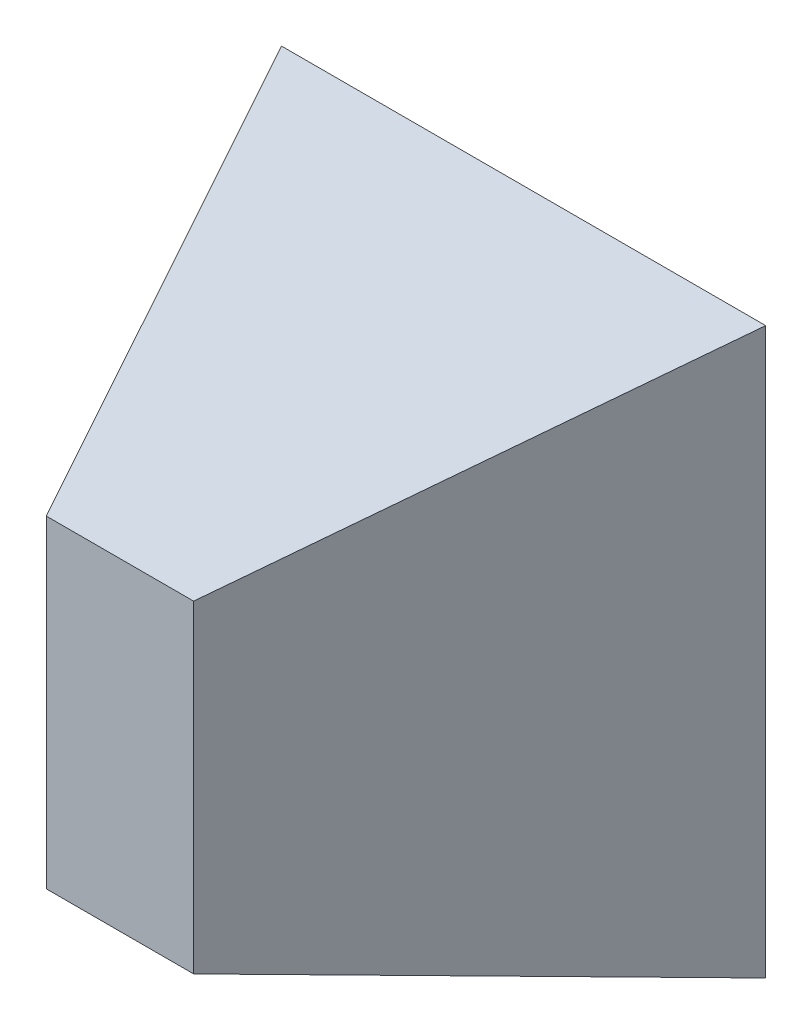
ISO-10303-21;
HEADER;
FILE_DESCRIPTION(('STEP AP214'),'2;1');
FILE_NAME('part.step','',(''),(''),'','','');
FILE_SCHEMA(('AUTOMOTIVE_DESIGN { 1 0 10303 214 1 1 1 1 }'));
ENDSEC;
DATA;
#1=APPLICATION_CONTEXT('core data for automotive mechanical design processes');
#2=APPLICATION_PROTOCOL_DEFINITION('international standard','automotive_design',2000,#1);
#3=PRODUCT_CONTEXT('',#1,'mechanical');
#4=PRODUCT('Part','Part','',(#3));
#5=PRODUCT_RELATED_PRODUCT_CATEGORY('part','',(#4));
#6=PRODUCT_DEFINITION_FORMATION('','',#4);
#7=PRODUCT_DEFINITION_CONTEXT('part definition',#1,'design');
#8=PRODUCT_DEFINITION('design','',#6,#7);
#9=PRODUCT_DEFINITION_SHAPE('','',#8);
#10=(LENGTH_UNIT() NAMED_UNIT(*) SI_UNIT(.MILLI.,.METRE.));
#11=(NAMED_UNIT(*) PLANE_ANGLE_UNIT() SI_UNIT($,.RADIAN.));
#12=(NAMED_UNIT(*) SI_UNIT($,.STERADIAN.) SOLID_ANGLE_UNIT());
#13=UNCERTAINTY_MEASURE_WITH_UNIT(LENGTH_MEASURE(1.E-05),#10,'distance_accuracy_value','');
#14=(GEOMETRIC_REPRESENTATION_CONTEXT(3) GLOBAL_UNCERTAINTY_ASSIGNED_CONTEXT((#13)) GLOBAL_UNIT_ASSIGNED_CONTEXT((#10,
#11,#12)) REPRESENTATION_CONTEXT('',''));
#15=CARTESIAN_POINT('',(0.,0.,0.));
#16=DIRECTION('',(0.,0.,1.));
#17=DIRECTION('',(1.,0.,0.));
#18=AXIS2_PLACEMENT_3D('',#15,#16,#17);
#19=CARTESIAN_POINT('',(0.,0.,0.));
#20=DIRECTION('',(0.,0.,-1.));
#21=DIRECTION('',(-1.,0.,0.));
#22=AXIS2_PLACEMENT_3D('',#19,#20,#21);
#23=PLANE('',#22);
#24=DIRECTION('',(0.,1.,0.));
#25=VECTOR('',#24,1.);
#26=CARTESIAN_POINT('',(152.4,-177.8,0.));
#27=LINE('',#26,#25);
#28=CARTESIAN_POINT('',(152.4,-177.8,0.));
#29=VERTEX_POINT('',#28);
#30=CARTESIAN_POINT('',(152.4,177.8,0.));
#31=VERTEX_POINT('',#30);
#32=EDGE_CURVE('E102',#29,#31,#27,.T.);
#33=ORIENTED_EDGE('',*,*,#32,.F.);
#34=DIRECTION('',(1.,0.,0.));
#35=VECTOR('',#34,1.);
#36=CARTESIAN_POINT('',(-152.4,-177.8,0.));
#37=LINE('',#36,#35);
#38=CARTESIAN_POINT('',(-152.4,-177.8,0.));
#39=VERTEX_POINT('',#38);
#40=EDGE_CURVE('E12',#39,#29,#37,.T.);
#41=ORIENTED_EDGE('',*,*,#40,.F.);
#42=DIRECTION('',(0.,-1.,0.));
#43=VECTOR('',#42,1.);
#44=CARTESIAN_POINT('',(-152.4,-177.8,0.));
#45=LINE('',#44,#43);
#46=CARTESIAN_POINT('',(-152.4,177.8,0.));
#47=VERTEX_POINT('',#46);
#48=EDGE_CURVE('E58',#47,#39,#45,.T.);
#49=ORIENTED_EDGE('',*,*,#48,.F.);
#50=DIRECTION('',(-1.,0.,0.));
#51=VECTOR('',#50,1.);
#52=CARTESIAN_POINT('',(-152.4,177.8,0.));
#53=LINE('',#52,#51);
#54=EDGE_CURVE('E187',#31,#47,#53,.T.);
#55=ORIENTED_EDGE('',*,*,#54,.F.);
#56=EDGE_LOOP('',(#33,#41,#49,#55));
#57=FACE_BOUND('',#56,.T.);
#58=ADVANCED_FACE('F48',(#57),#23,.T.);
#59=CARTESIAN_POINT('',(0.,0.,254.));
#60=DIRECTION('',(0.,0.,-1.));
#61=DIRECTION('',(-1.,0.,0.));
#62=AXIS2_PLACEMENT_3D('',#59,#60,#61);
#63=PLANE('',#62);
#64=DIRECTION('',(0.,1.,0.));
#65=VECTOR('',#64,1.);
#66=CARTESIAN_POINT('',(46.355,-101.6,254.));
#67=LINE('',#66,#65);
#68=CARTESIAN_POINT('',(46.355,-101.6,254.));
#69=VERTEX_POINT('',#68);
#70=CARTESIAN_POINT('',(46.355,101.6,254.));
#71=VERTEX_POINT('',#70);
#72=EDGE_CURVE('E156',#69,#71,#67,.T.);
#73=ORIENTED_EDGE('',*,*,#72,.T.);
#74=DIRECTION('',(-1.,0.,0.));
#75=VECTOR('',#74,1.);
#76=CARTESIAN_POINT('',(-46.355,101.6,254.));
#77=LINE('',#76,#75);
#78=CARTESIAN_POINT('',(-46.355,101.6,254.));
#79=VERTEX_POINT('',#78);
#80=EDGE_CURVE('E116',#71,#79,#77,.T.);
#81=ORIENTED_EDGE('',*,*,#80,.T.);
#82=DIRECTION('',(0.,-1.,0.));
#83=VECTOR('',#82,1.);
#84=CARTESIAN_POINT('',(-46.355,-101.6,254.));
#85=LINE('',#84,#83);
#86=CARTESIAN_POINT('',(-46.355,-101.6,254.));
#87=VERTEX_POINT('',#86);
#88=EDGE_CURVE('E97',#79,#87,#85,.T.);
#89=ORIENTED_EDGE('',*,*,#88,.T.);
#90=DIRECTION('',(1.,0.,0.));
#91=VECTOR('',#90,1.);
#92=CARTESIAN_POINT('',(-46.355,-101.6,254.));
#93=LINE('',#92,#91);
#94=EDGE_CURVE('E104',#87,#69,#93,.T.);
#95=ORIENTED_EDGE('',*,*,#94,.T.);
#96=EDGE_LOOP('',(#73,#81,#89,#95));
#97=FACE_BOUND('',#96,.T.);
#98=ADVANCED_FACE('F115',(#97),#63,.F.);
#99=CARTESIAN_POINT('',(0.,163.119266055046,48.9357798165137));
#100=DIRECTION('',(0.,0.957826285221151,0.287347885566345));
#101=DIRECTION('',(0.,-0.287347885566345,0.957826285221151));
#102=AXIS2_PLACEMENT_3D('',#99,#100,#101);
#103=PLANE('',#102);
#104=DIRECTION('',(0.371304606644695,0.266805705373433,-0.889352351244777));
#105=VECTOR('',#104,1.);
#106=CARTESIAN_POINT('',(46.355,101.6,254.));
#107=LINE('',#106,#105);
#108=EDGE_CURVE('E110',#71,#31,#107,.T.);
#109=ORIENTED_EDGE('',*,*,#108,.T.);
#110=ORIENTED_EDGE('',*,*,#54,.T.);
#111=DIRECTION('',(-0.371304606644694,0.266805705373433,-0.889352351244777));
#112=VECTOR('',#111,1.);
#113=CARTESIAN_POINT('',(-46.355,101.6,254.));
#114=LINE('',#113,#112);
#115=EDGE_CURVE('E200',#79,#47,#114,.T.);
#116=ORIENTED_EDGE('',*,*,#115,.F.);
#117=ORIENTED_EDGE('',*,*,#80,.F.);
#118=EDGE_LOOP('',(#109,#110,#116,#117));
#119=FACE_BOUND('',#118,.T.);
#120=ADVANCED_FACE('F135',(#119),#103,.T.);
#121=CARTESIAN_POINT('',(-129.778752348461,0.,54.1826291054825));
#122=DIRECTION('',(-0.922803671676548,0.,0.385270532924959));
#123=DIRECTION('',(0.385270532924959,0.,0.922803671676548));
#124=AXIS2_PLACEMENT_3D('',#121,#122,#123);
#125=PLANE('',#124);
#126=ORIENTED_EDGE('',*,*,#115,.T.);
#127=ORIENTED_EDGE('',*,*,#48,.T.);
#128=DIRECTION('',(-0.371304606644695,-0.266805705373433,-0.889352351244777));
#129=VECTOR('',#128,1.);
#130=CARTESIAN_POINT('',(-46.355,-101.6,254.));
#131=LINE('',#130,#129);
#132=EDGE_CURVE('E92',#87,#39,#131,.T.);
#133=ORIENTED_EDGE('',*,*,#132,.F.);
#134=ORIENTED_EDGE('',*,*,#88,.F.);
#135=EDGE_LOOP('',(#126,#127,#133,#134));
#136=FACE_BOUND('',#135,.T.);
#137=ADVANCED_FACE('F95',(#136),#125,.T.);
#138=CARTESIAN_POINT('',(129.778752348461,0.,54.1826291054825));
#139=DIRECTION('',(0.922803671676548,0.,0.385270532924959));
#140=DIRECTION('',(0.385270532924959,0.,-0.922803671676548));
#141=AXIS2_PLACEMENT_3D('',#138,#139,#140);
#142=PLANE('',#141);
#143=DIRECTION('',(0.371304606644695,-0.266805705373433,-0.889352351244777));
#144=VECTOR('',#143,1.);
#145=CARTESIAN_POINT('',(46.355,-101.6,254.));
#146=LINE('',#145,#144);
#147=EDGE_CURVE('E66',#69,#29,#146,.T.);
#148=ORIENTED_EDGE('',*,*,#147,.T.);
#149=ORIENTED_EDGE('',*,*,#32,.T.);
#150=ORIENTED_EDGE('',*,*,#108,.F.);
#151=ORIENTED_EDGE('',*,*,#72,.F.);
#152=EDGE_LOOP('',(#148,#149,#150,#151));
#153=FACE_BOUND('',#152,.T.);
#154=ADVANCED_FACE('F194',(#153),#142,.T.);
#155=CARTESIAN_POINT('',(0.,-163.119266055046,48.9357798165137));
#156=DIRECTION('',(0.,-0.957826285221151,0.287347885566345));
#157=DIRECTION('',(0.,-0.287347885566345,-0.957826285221151));
#158=AXIS2_PLACEMENT_3D('',#155,#156,#157);
#159=PLANE('',#158);
#160=ORIENTED_EDGE('',*,*,#132,.T.);
#161=ORIENTED_EDGE('',*,*,#40,.T.);
#162=ORIENTED_EDGE('',*,*,#147,.F.);
#163=ORIENTED_EDGE('',*,*,#94,.F.);
#164=EDGE_LOOP('',(#160,#161,#162,#163));
#165=FACE_BOUND('',#164,.T.);
#166=ADVANCED_FACE('F106',(#165),#159,.T.);
#167=CLOSED_SHELL('',(#58,#98,#120,#137,#154,#166));
#168=MANIFOLD_SOLID_BREP('B2',#167);
#169=ADVANCED_BREP_SHAPE_REPRESENTATION('',(#18,#168),#14);
#170=SHAPE_DEFINITION_REPRESENTATION(#9,#169);
ENDSEC;
END-ISO-10303-21;
